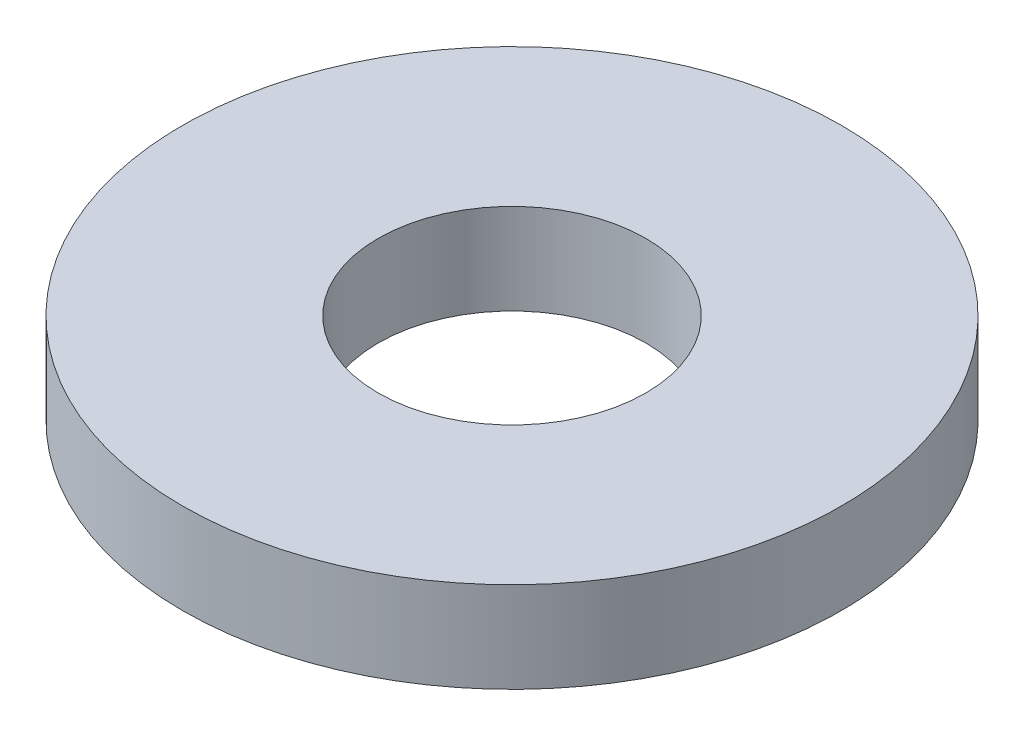
ISO-10303-21;
HEADER;
FILE_DESCRIPTION(('STEP AP214'),'2;1');
FILE_NAME('part.step','',(''),(''),'','','');
FILE_SCHEMA(('AUTOMOTIVE_DESIGN { 1 0 10303 214 1 1 1 1 }'));
ENDSEC;
DATA;
#1=APPLICATION_CONTEXT('core data for automotive mechanical design processes');
#2=APPLICATION_PROTOCOL_DEFINITION('international standard','automotive_design',2000,#1);
#3=PRODUCT_CONTEXT('',#1,'mechanical');
#4=PRODUCT('Part','Part','',(#3));
#5=PRODUCT_RELATED_PRODUCT_CATEGORY('part','',(#4));
#6=PRODUCT_DEFINITION_FORMATION('','',#4);
#7=PRODUCT_DEFINITION_CONTEXT('part definition',#1,'design');
#8=PRODUCT_DEFINITION('design','',#6,#7);
#9=PRODUCT_DEFINITION_SHAPE('','',#8);
#10=(LENGTH_UNIT() NAMED_UNIT(*) SI_UNIT(.MILLI.,.METRE.));
#11=(NAMED_UNIT(*) PLANE_ANGLE_UNIT() SI_UNIT($,.RADIAN.));
#12=(NAMED_UNIT(*) SI_UNIT($,.STERADIAN.) SOLID_ANGLE_UNIT());
#13=UNCERTAINTY_MEASURE_WITH_UNIT(LENGTH_MEASURE(1.E-05),#10,'distance_accuracy_value','');
#14=(GEOMETRIC_REPRESENTATION_CONTEXT(3) GLOBAL_UNCERTAINTY_ASSIGNED_CONTEXT((#13)) GLOBAL_UNIT_ASSIGNED_CONTEXT((#10,
#11,#12)) REPRESENTATION_CONTEXT('',''));
#15=CARTESIAN_POINT('',(0.,0.,0.));
#16=DIRECTION('',(0.,0.,1.));
#17=DIRECTION('',(1.,0.,0.));
#18=AXIS2_PLACEMENT_3D('',#15,#16,#17);
#19=CARTESIAN_POINT('',(0.,22.,0.));
#20=DIRECTION('',(0.,-1.,0.));
#21=DIRECTION('',(0.,0.,-1.));
#22=AXIS2_PLACEMENT_3D('',#19,#20,#21);
#23=CYLINDRICAL_SURFACE('',#22,80.);
#24=CARTESIAN_POINT('',(0.,22.,0.));
#25=DIRECTION('',(0.,1.,0.));
#26=DIRECTION('',(0.,0.,1.));
#27=AXIS2_PLACEMENT_3D('',#24,#25,#26);
#28=CIRCLE('',#27,80.);
#29=CARTESIAN_POINT('',(0.,22.,80.));
#30=VERTEX_POINT('',#29);
#31=EDGE_CURVE('E10',#30,#30,#28,.T.);
#32=ORIENTED_EDGE('',*,*,#31,.F.);
#33=EDGE_LOOP('',(#32));
#34=FACE_BOUND('',#33,.T.);
#35=CARTESIAN_POINT('',(0.,0.,0.));
#36=DIRECTION('',(0.,1.,0.));
#37=DIRECTION('',(0.,0.,1.));
#38=AXIS2_PLACEMENT_3D('',#35,#36,#37);
#39=CIRCLE('',#38,80.);
#40=CARTESIAN_POINT('',(0.,0.,80.));
#41=VERTEX_POINT('',#40);
#42=EDGE_CURVE('E37',#41,#41,#39,.T.);
#43=ORIENTED_EDGE('',*,*,#42,.T.);
#44=EDGE_LOOP('',(#43));
#45=FACE_BOUND('',#44,.T.);
#46=ADVANCED_FACE('F40',(#34,#45),#23,.T.);
#47=CARTESIAN_POINT('',(0.,22.,0.));
#48=DIRECTION('',(0.,1.,0.));
#49=DIRECTION('',(0.,0.,1.));
#50=AXIS2_PLACEMENT_3D('',#47,#48,#49);
#51=PLANE('',#50);
#52=CARTESIAN_POINT('',(0.,22.,0.));
#53=DIRECTION('',(0.,1.,0.));
#54=DIRECTION('',(0.,0.,1.));
#55=AXIS2_PLACEMENT_3D('',#52,#53,#54);
#56=CIRCLE('',#55,32.5);
#57=CARTESIAN_POINT('',(0.,22.,32.5));
#58=VERTEX_POINT('',#57);
#59=EDGE_CURVE('E50',#58,#58,#56,.T.);
#60=ORIENTED_EDGE('',*,*,#59,.F.);
#61=EDGE_LOOP('',(#60));
#62=FACE_BOUND('',#61,.T.);
#63=ORIENTED_EDGE('',*,*,#31,.T.);
#64=EDGE_LOOP('',(#63));
#65=FACE_BOUND('',#64,.T.);
#66=ADVANCED_FACE('F59',(#62,#65),#51,.T.);
#67=CARTESIAN_POINT('',(0.,0.,0.));
#68=DIRECTION('',(0.,1.,0.));
#69=DIRECTION('',(0.,0.,1.));
#70=AXIS2_PLACEMENT_3D('',#67,#68,#69);
#71=PLANE('',#70);
#72=CARTESIAN_POINT('',(0.,0.,0.));
#73=DIRECTION('',(0.,1.,0.));
#74=DIRECTION('',(0.,0.,1.));
#75=AXIS2_PLACEMENT_3D('',#72,#73,#74);
#76=CIRCLE('',#75,32.5);
#77=CARTESIAN_POINT('',(0.,0.,32.5));
#78=VERTEX_POINT('',#77);
#79=EDGE_CURVE('E47',#78,#78,#76,.T.);
#80=ORIENTED_EDGE('',*,*,#79,.T.);
#81=EDGE_LOOP('',(#80));
#82=FACE_BOUND('',#81,.T.);
#83=ORIENTED_EDGE('',*,*,#42,.F.);
#84=EDGE_LOOP('',(#83));
#85=FACE_BOUND('',#84,.T.);
#86=ADVANCED_FACE('F58',(#82,#85),#71,.F.);
#87=CARTESIAN_POINT('',(0.,22.,0.));
#88=DIRECTION('',(0.,-1.,0.));
#89=DIRECTION('',(0.,0.,-1.));
#90=AXIS2_PLACEMENT_3D('',#87,#88,#89);
#91=CYLINDRICAL_SURFACE('',#90,32.5);
#92=ORIENTED_EDGE('',*,*,#59,.T.);
#93=EDGE_LOOP('',(#92));
#94=FACE_BOUND('',#93,.T.);
#95=ORIENTED_EDGE('',*,*,#79,.F.);
#96=EDGE_LOOP('',(#95));
#97=FACE_BOUND('',#96,.T.);
#98=ADVANCED_FACE('F54',(#94,#97),#91,.F.);
#99=CLOSED_SHELL('',(#46,#66,#86,#98));
#100=MANIFOLD_SOLID_BREP('B2',#99);
#101=ADVANCED_BREP_SHAPE_REPRESENTATION('',(#18,#100),#14);
#102=SHAPE_DEFINITION_REPRESENTATION(#9,#101);
ENDSEC;
END-ISO-10303-21;
